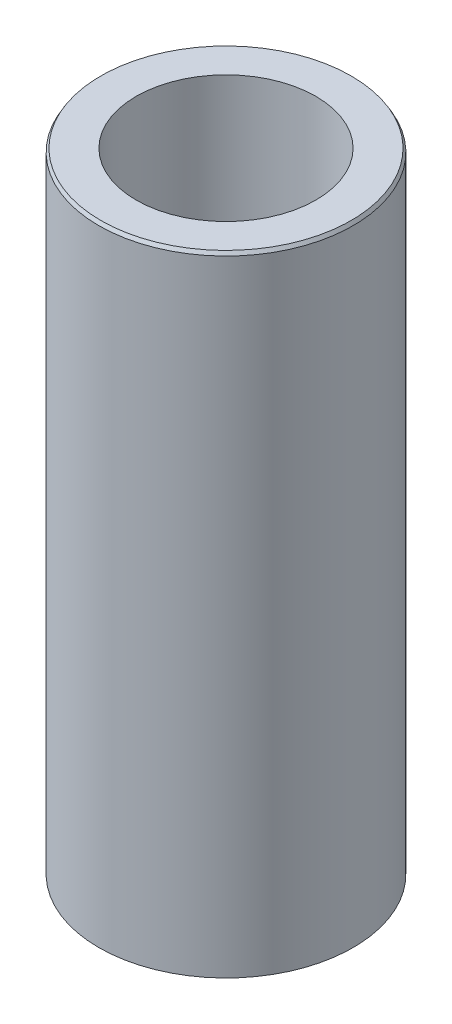
ISO-10303-21;
HEADER;
FILE_DESCRIPTION(('STEP AP214'),'2;1');
FILE_NAME('part.step','',(''),(''),'','','');
FILE_SCHEMA(('AUTOMOTIVE_DESIGN { 1 0 10303 214 1 1 1 1 }'));
ENDSEC;
DATA;
#1=APPLICATION_CONTEXT('core data for automotive mechanical design processes');
#2=APPLICATION_PROTOCOL_DEFINITION('international standard','automotive_design',2000,#1);
#3=PRODUCT_CONTEXT('',#1,'mechanical');
#4=PRODUCT('Part','Part','',(#3));
#5=PRODUCT_RELATED_PRODUCT_CATEGORY('part','',(#4));
#6=PRODUCT_DEFINITION_FORMATION('','',#4);
#7=PRODUCT_DEFINITION_CONTEXT('part definition',#1,'design');
#8=PRODUCT_DEFINITION('design','',#6,#7);
#9=PRODUCT_DEFINITION_SHAPE('','',#8);
#10=(LENGTH_UNIT() NAMED_UNIT(*) SI_UNIT(.MILLI.,.METRE.));
#11=(NAMED_UNIT(*) PLANE_ANGLE_UNIT() SI_UNIT($,.RADIAN.));
#12=(NAMED_UNIT(*) SI_UNIT($,.STERADIAN.) SOLID_ANGLE_UNIT());
#13=UNCERTAINTY_MEASURE_WITH_UNIT(LENGTH_MEASURE(1.E-05),#10,'distance_accuracy_value','');
#14=(GEOMETRIC_REPRESENTATION_CONTEXT(3) GLOBAL_UNCERTAINTY_ASSIGNED_CONTEXT((#13)) GLOBAL_UNIT_ASSIGNED_CONTEXT((#10,
#11,#12)) REPRESENTATION_CONTEXT('',''));
#15=CARTESIAN_POINT('',(0.,0.,0.));
#16=DIRECTION('',(0.,0.,1.));
#17=DIRECTION('',(1.,0.,0.));
#18=AXIS2_PLACEMENT_3D('',#15,#16,#17);
#19=CARTESIAN_POINT('',(0.,247.905329002557,0.));
#20=DIRECTION('',(0.,-1.,0.));
#21=DIRECTION('',(0.,0.,-1.));
#22=AXIS2_PLACEMENT_3D('',#19,#20,#21);
#23=CYLINDRICAL_SURFACE('',#22,50.);
#24=CARTESIAN_POINT('',(0.,246.541570443681,0.));
#25=DIRECTION('',(0.,1.,0.));
#26=DIRECTION('',(0.,0.,1.));
#27=AXIS2_PLACEMENT_3D('',#24,#25,#26);
#28=CIRCLE('',#27,50.);
#29=CARTESIAN_POINT('',(0.,246.541570443681,-50.));
#30=VERTEX_POINT('',#29);
#31=EDGE_CURVE('E50',#30,#30,#28,.F.);
#32=ORIENTED_EDGE('',*,*,#31,.T.);
#33=EDGE_LOOP('',(#32));
#34=FACE_BOUND('',#33,.T.);
#35=CARTESIAN_POINT('',(0.,0.787366371076265,0.));
#36=DIRECTION('',(0.,1.,0.));
#37=DIRECTION('',(0.,0.,1.));
#38=AXIS2_PLACEMENT_3D('',#35,#36,#37);
#39=CIRCLE('',#38,50.);
#40=CARTESIAN_POINT('',(0.,0.787366371076265,50.));
#41=VERTEX_POINT('',#40);
#42=EDGE_CURVE('E51',#41,#41,#39,.T.);
#43=ORIENTED_EDGE('',*,*,#42,.T.);
#44=EDGE_LOOP('',(#43));
#45=FACE_BOUND('',#44,.T.);
#46=ADVANCED_FACE('F39',(#34,#45),#23,.T.);
#47=CARTESIAN_POINT('',(0.,247.905329002557,0.));
#48=DIRECTION('',(0.,1.,0.));
#49=DIRECTION('',(0.,0.,1.));
#50=AXIS2_PLACEMENT_3D('',#47,#48,#49);
#51=PLANE('',#50);
#52=CARTESIAN_POINT('',(0.,247.905329002557,0.));
#53=DIRECTION('',(0.,1.,0.));
#54=DIRECTION('',(0.,0.,1.));
#55=AXIS2_PLACEMENT_3D('',#52,#53,#54);
#56=CIRCLE('',#55,49.2126336289236);
#57=CARTESIAN_POINT('',(0.,247.905329002557,-49.2126336289236));
#58=VERTEX_POINT('',#57);
#59=EDGE_CURVE('E54',#58,#58,#56,.T.);
#60=ORIENTED_EDGE('',*,*,#59,.T.);
#61=EDGE_LOOP('',(#60));
#62=FACE_BOUND('',#61,.T.);
#63=CARTESIAN_POINT('',(0.,247.905329002557,0.));
#64=DIRECTION('',(0.,1.,0.));
#65=DIRECTION('',(0.,0.,1.));
#66=AXIS2_PLACEMENT_3D('',#63,#64,#65);
#67=CIRCLE('',#66,35.3265139732558);
#68=CARTESIAN_POINT('',(0.,247.905329002557,35.3265139732558));
#69=VERTEX_POINT('',#68);
#70=EDGE_CURVE('E58',#69,#69,#67,.T.);
#71=ORIENTED_EDGE('',*,*,#70,.F.);
#72=EDGE_LOOP('',(#71));
#73=FACE_BOUND('',#72,.T.);
#74=ADVANCED_FACE('F69',(#62,#73),#51,.T.);
#75=CARTESIAN_POINT('',(0.,0.,0.));
#76=DIRECTION('',(0.,1.,0.));
#77=DIRECTION('',(0.,0.,1.));
#78=AXIS2_PLACEMENT_3D('',#75,#76,#77);
#79=PLANE('',#78);
#80=CARTESIAN_POINT('',(0.,0.,0.));
#81=DIRECTION('',(0.,1.,0.));
#82=DIRECTION('',(0.,0.,1.));
#83=AXIS2_PLACEMENT_3D('',#80,#81,#82);
#84=CIRCLE('',#83,48.6362414411248);
#85=CARTESIAN_POINT('',(0.,0.,48.6362414411248));
#86=VERTEX_POINT('',#85);
#87=EDGE_CURVE('E10',#86,#86,#84,.F.);
#88=ORIENTED_EDGE('',*,*,#87,.T.);
#89=EDGE_LOOP('',(#88));
#90=FACE_BOUND('',#89,.T.);
#91=CARTESIAN_POINT('',(0.,0.,0.));
#92=DIRECTION('',(0.,1.,0.));
#93=DIRECTION('',(0.,0.,1.));
#94=AXIS2_PLACEMENT_3D('',#91,#92,#93);
#95=CIRCLE('',#94,35.3265139732558);
#96=CARTESIAN_POINT('',(0.,0.,35.3265139732558));
#97=VERTEX_POINT('',#96);
#98=EDGE_CURVE('E63',#97,#97,#95,.T.);
#99=ORIENTED_EDGE('',*,*,#98,.T.);
#100=EDGE_LOOP('',(#99));
#101=FACE_BOUND('',#100,.T.);
#102=ADVANCED_FACE('F75',(#90,#101),#79,.F.);
#103=CARTESIAN_POINT('',(0.,247.905329002557,0.));
#104=DIRECTION('',(0.,-1.,0.));
#105=DIRECTION('',(0.,0.,-1.));
#106=AXIS2_PLACEMENT_3D('',#103,#104,#105);
#107=CYLINDRICAL_SURFACE('',#106,35.3265139732558);
#108=ORIENTED_EDGE('',*,*,#70,.T.);
#109=EDGE_LOOP('',(#108));
#110=FACE_BOUND('',#109,.T.);
#111=ORIENTED_EDGE('',*,*,#98,.F.);
#112=EDGE_LOOP('',(#111));
#113=FACE_BOUND('',#112,.T.);
#114=ADVANCED_FACE('F70',(#110,#113),#107,.F.);
#115=CARTESIAN_POINT('',(0.,247.905329002557,0.));
#116=DIRECTION('',(0.,-1.,0.));
#117=DIRECTION('',(0.,0.,-1.));
#118=AXIS2_PLACEMENT_3D('',#115,#116,#117);
#119=CONICAL_SURFACE('',#118,49.2126336289236,0.523598775598309);
#120=CARTESIAN_POINT('',(0.,246.541570443681,-50.));
#121=CARTESIAN_POINT('',(0.,246.555776262003,-49.991798266968));
#122=CARTESIAN_POINT('',(0.,246.569982080325,-49.9835965339359));
#123=CARTESIAN_POINT('',(0.,246.598393716968,-49.9671930678718));
#124=CARTESIAN_POINT('',(0.,246.612599535289,-49.9589913348398));
#125=CARTESIAN_POINT('',(0.,246.641011171933,-49.9425878687757));
#126=CARTESIAN_POINT('',(0.,246.655216990254,-49.9343861357436));
#127=CARTESIAN_POINT('',(0.,246.683628626897,-49.9179826696796));
#128=CARTESIAN_POINT('',(0.,246.697834445219,-49.9097809366475));
#129=CARTESIAN_POINT('',(0.,246.726246081862,-49.8933774705834));
#130=CARTESIAN_POINT('',(0.,246.740451900184,-49.8851757375514));
#131=CARTESIAN_POINT('',(0.,246.768863536827,-49.8687722714873));
#132=CARTESIAN_POINT('',(0.,246.783069355149,-49.8605705384552));
#133=CARTESIAN_POINT('',(0.,246.811480991792,-49.8441670723912));
#134=CARTESIAN_POINT('',(0.,246.825686810114,-49.8359653393591));
#135=CARTESIAN_POINT('',(0.,246.854098446757,-49.819561873295));
#136=CARTESIAN_POINT('',(0.,246.868304265079,-49.811360140263));
#137=CARTESIAN_POINT('',(0.,246.896715901722,-49.7949566741989));
#138=CARTESIAN_POINT('',(0.,246.910921720043,-49.7867549411668));
#139=CARTESIAN_POINT('',(0.,246.939333356687,-49.7703514751027));
#140=CARTESIAN_POINT('',(0.,246.953539175008,-49.7621497420707));
#141=CARTESIAN_POINT('',(0.,246.981950811651,-49.7457462760066));
#142=CARTESIAN_POINT('',(0.,246.996156629973,-49.7375445429746));
#143=CARTESIAN_POINT('',(0.,247.024568266616,-49.7211410769105));
#144=CARTESIAN_POINT('',(0.,247.038774084938,-49.7129393438784));
#145=CARTESIAN_POINT('',(0.,247.067185721581,-49.6965358778143));
#146=CARTESIAN_POINT('',(0.,247.081391539903,-49.6883341447823));
#147=CARTESIAN_POINT('',(0.,247.109803176546,-49.6719306787182));
#148=CARTESIAN_POINT('',(0.,247.124008994868,-49.6637289456861));
#149=CARTESIAN_POINT('',(0.,247.152420631511,-49.6473254796221));
#150=CARTESIAN_POINT('',(0.,247.166626449832,-49.63912374659));
#151=CARTESIAN_POINT('',(0.,247.195038086476,-49.6227202805259));
#152=CARTESIAN_POINT('',(0.,247.209243904797,-49.6145185474939));
#153=CARTESIAN_POINT('',(0.,247.237655541441,-49.5981150814298));
#154=CARTESIAN_POINT('',(0.,247.251861359762,-49.5899133483977));
#155=CARTESIAN_POINT('',(0.,247.280272996405,-49.5735098823337));
#156=CARTESIAN_POINT('',(0.,247.294478814727,-49.5653081493016));
#157=CARTESIAN_POINT('',(0.,247.32289045137,-49.5489046832375));
#158=CARTESIAN_POINT('',(0.,247.337096269692,-49.5407029502055));
#159=CARTESIAN_POINT('',(0.,247.365507906335,-49.5242994841414));
#160=CARTESIAN_POINT('',(0.,247.379713724657,-49.5160977511093));
#161=CARTESIAN_POINT('',(0.,247.4081253613,-49.4996942850452));
#162=CARTESIAN_POINT('',(0.,247.422331179622,-49.4914925520132));
#163=CARTESIAN_POINT('',(0.,247.450742816265,-49.4750890859491));
#164=CARTESIAN_POINT('',(0.,247.464948634586,-49.4668873529171));
#165=CARTESIAN_POINT('',(0.,247.49336027123,-49.450483886853));
#166=CARTESIAN_POINT('',(0.,247.507566089551,-49.4422821538209));
#167=CARTESIAN_POINT('',(0.,247.535977726195,-49.4258786877568));
#168=CARTESIAN_POINT('',(0.,247.550183544516,-49.4176769547248));
#169=CARTESIAN_POINT('',(0.,247.578595181159,-49.4012734886607));
#170=CARTESIAN_POINT('',(0.,247.592800999481,-49.3930717556286));
#171=CARTESIAN_POINT('',(0.,247.621212636124,-49.3766682895645));
#172=CARTESIAN_POINT('',(0.,247.635418454446,-49.3684665565325));
#173=CARTESIAN_POINT('',(0.,247.663830091089,-49.3520630904684));
#174=CARTESIAN_POINT('',(0.,247.678035909411,-49.3438613574364));
#175=CARTESIAN_POINT('',(0.,247.706447546054,-49.3274578913723));
#176=CARTESIAN_POINT('',(0.,247.720653364376,-49.3192561583402));
#177=CARTESIAN_POINT('',(0.,247.749065001019,-49.3028526922761));
#178=CARTESIAN_POINT('',(0.,247.76327081934,-49.2946509592441));
#179=CARTESIAN_POINT('',(0.,247.791682455984,-49.27824749318));
#180=CARTESIAN_POINT('',(0.,247.805888274305,-49.270045760148));
#181=CARTESIAN_POINT('',(0.,247.834299910949,-49.2536422940839));
#182=CARTESIAN_POINT('',(0.,247.84850572927,-49.2454405610518));
#183=CARTESIAN_POINT('',(0.,247.876917365913,-49.2290370949877));
#184=CARTESIAN_POINT('',(0.,247.891123184235,-49.2208353619557));
#185=CARTESIAN_POINT('',(0.,247.905329002557,-49.2126336289236));
#186=B_SPLINE_CURVE_WITH_KNOTS('',3,(#120,#121,#122,#123,#124,#125,#126,#127,#128,#129,#130,
#131,#132,#133,#134,#135,#136,#137,#138,#139,#140,#141,#142,#143,#144,#145,#146,#147,#148,#149,
#150,#151,#152,#153,#154,#155,#156,#157,#158,#159,#160,#161,#162,#163,#164,#165,#166,#167,#168,
#169,#170,#171,#172,#173,#174,#175,#176,#177,#178,#179,#180,#181,#182,#183,#184,#185),
.UNSPECIFIED.,.F.,.F.,(4,2,2,2,2,2,2,2,2,2,2,2,2,2,2,2,2,2,2,2,2,2,2,2,2,2,2,2,2,2,2,2,4),(0.,
0.0492103981922795,0.0984207963845625,0.147631194576821,0.196841592769101,0.24605199096136,
0.295262389153639,0.344472787345922,0.393683185538178,0.442893583730461,0.492103981922716,
0.541314380114999,0.590524778307282,0.639735176499538,0.688945574691821,0.738155972884076,
0.787366371076359,0.836576769268639,0.885787167460898,0.934997565653181,0.984207963845437,
1.03341836203772,1.08262876023,1.13183915842226,1.18104955661454,1.2302599548068,
1.27947035299908,1.32868075119136,1.37789114938362,1.4271015475759,1.47631194576816,
1.52552234396044,1.57473274215272),.UNSPECIFIED.);
#187=EDGE_CURVE('BSEAM81',#30,#58,#186,.T.);
#188=ORIENTED_EDGE('',*,*,#31,.F.);
#189=ORIENTED_EDGE('',*,*,#59,.F.);
#190=ORIENTED_EDGE('',*,*,#187,.T.);
#191=ORIENTED_EDGE('',*,*,#187,.F.);
#192=EDGE_LOOP('',(#188,#190,#189,#191));
#193=FACE_BOUND('',#192,.T.);
#194=ADVANCED_FACE('F81',(#193),#119,.T.);
#195=CARTESIAN_POINT('',(0.,0.787366371076265,0.));
#196=DIRECTION('',(0.,1.,0.));
#197=DIRECTION('',(0.,0.,1.));
#198=AXIS2_PLACEMENT_3D('',#195,#196,#197);
#199=CONICAL_SURFACE('',#198,50.,1.0471975511966);
#200=ORIENTED_EDGE('',*,*,#87,.F.);
#201=EDGE_LOOP('',(#200));
#202=FACE_BOUND('',#201,.T.);
#203=ORIENTED_EDGE('',*,*,#42,.F.);
#204=EDGE_LOOP('',(#203));
#205=FACE_BOUND('',#204,.T.);
#206=ADVANCED_FACE('F45',(#202,#205),#199,.T.);
#207=CLOSED_SHELL('',(#46,#74,#102,#114,#194,#206));
#208=MANIFOLD_SOLID_BREP('B2',#207);
#209=ADVANCED_BREP_SHAPE_REPRESENTATION('',(#18,#208),#14);
#210=SHAPE_DEFINITION_REPRESENTATION(#9,#209);
ENDSEC;
END-ISO-10303-21;
